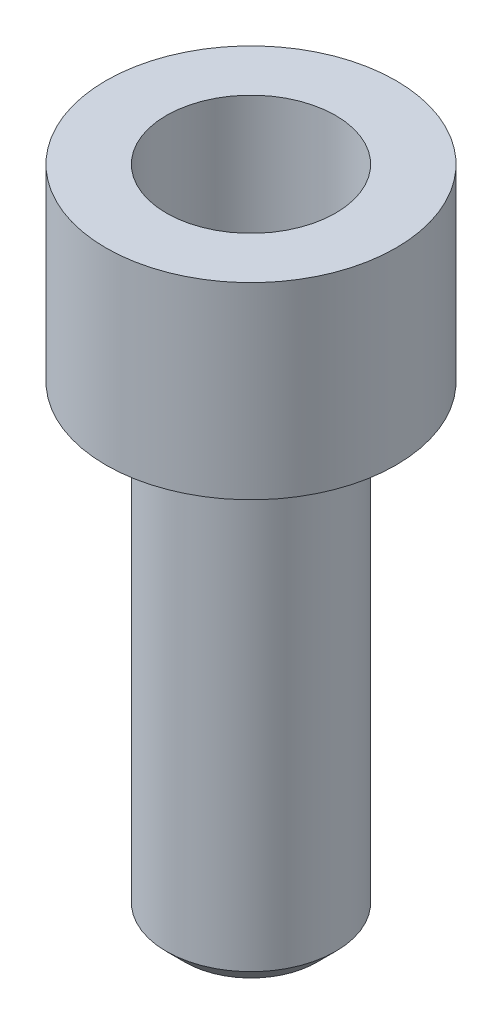
ISO-10303-21;
HEADER;
FILE_DESCRIPTION(('STEP AP214'),'2;1');
FILE_NAME('part.step','',(''),(''),'','','');
FILE_SCHEMA(('AUTOMOTIVE_DESIGN { 1 0 10303 214 1 1 1 1 }'));
ENDSEC;
DATA;
#1=APPLICATION_CONTEXT('core data for automotive mechanical design processes');
#2=APPLICATION_PROTOCOL_DEFINITION('international standard','automotive_design',2000,#1);
#3=PRODUCT_CONTEXT('',#1,'mechanical');
#4=PRODUCT('Part','Part','',(#3));
#5=PRODUCT_RELATED_PRODUCT_CATEGORY('part','',(#4));
#6=PRODUCT_DEFINITION_FORMATION('','',#4);
#7=PRODUCT_DEFINITION_CONTEXT('part definition',#1,'design');
#8=PRODUCT_DEFINITION('design','',#6,#7);
#9=PRODUCT_DEFINITION_SHAPE('','',#8);
#10=(LENGTH_UNIT() NAMED_UNIT(*) SI_UNIT(.MILLI.,.METRE.));
#11=(NAMED_UNIT(*) PLANE_ANGLE_UNIT() SI_UNIT($,.RADIAN.));
#12=(NAMED_UNIT(*) SI_UNIT($,.STERADIAN.) SOLID_ANGLE_UNIT());
#13=UNCERTAINTY_MEASURE_WITH_UNIT(LENGTH_MEASURE(1.E-05),#10,'distance_accuracy_value','');
#14=(GEOMETRIC_REPRESENTATION_CONTEXT(3) GLOBAL_UNCERTAINTY_ASSIGNED_CONTEXT((#13)) GLOBAL_UNIT_ASSIGNED_CONTEXT((#10,
#11,#12)) REPRESENTATION_CONTEXT('',''));
#15=CARTESIAN_POINT('',(0.,0.,0.));
#16=DIRECTION('',(0.,0.,1.));
#17=DIRECTION('',(1.,0.,0.));
#18=AXIS2_PLACEMENT_3D('',#15,#16,#17);
#19=CARTESIAN_POINT('',(4.5,15.2880894128114,0.));
#20=DIRECTION('',(0.,-1.,0.));
#21=DIRECTION('',(0.,0.,-1.));
#22=AXIS2_PLACEMENT_3D('',#19,#20,#21);
#23=PLANE('',#22);
#24=CARTESIAN_POINT('',(0.,15.2880894128114,0.));
#25=DIRECTION('',(0.,1.,0.));
#26=DIRECTION('',(0.,0.,1.));
#27=AXIS2_PLACEMENT_3D('',#24,#25,#26);
#28=CIRCLE('',#27,4.5);
#29=CARTESIAN_POINT('',(0.,15.2880894128114,4.5));
#30=VERTEX_POINT('',#29);
#31=EDGE_CURVE('E56',#30,#30,#28,.T.);
#32=ORIENTED_EDGE('',*,*,#31,.T.);
#33=EDGE_LOOP('',(#32));
#34=FACE_BOUND('',#33,.T.);
#35=ADVANCED_FACE('F31',(#34),#23,.F.);
#36=CARTESIAN_POINT('',(0.,-12.5901912811388,0.));
#37=DIRECTION('',(0.,1.,0.));
#38=DIRECTION('',(0.,0.,1.));
#39=AXIS2_PLACEMENT_3D('',#36,#37,#38);
#40=PLANE('',#39);
#41=CARTESIAN_POINT('',(0.,-12.5901912811388,0.));
#42=DIRECTION('',(0.,1.,0.));
#43=DIRECTION('',(0.,0.,1.));
#44=AXIS2_PLACEMENT_3D('',#41,#42,#43);
#45=CIRCLE('',#44,3.5);
#46=CARTESIAN_POINT('',(0.,-12.5901912811388,3.5));
#47=VERTEX_POINT('',#46);
#48=EDGE_CURVE('E10',#47,#47,#45,.T.);
#49=ORIENTED_EDGE('',*,*,#48,.F.);
#50=EDGE_LOOP('',(#49));
#51=FACE_BOUND('',#50,.T.);
#52=ADVANCED_FACE('F92',(#51),#40,.F.);
#53=CARTESIAN_POINT('',(0.,-12.5901912811388,0.));
#54=DIRECTION('',(0.,1.,0.));
#55=DIRECTION('',(0.,0.,1.));
#56=AXIS2_PLACEMENT_3D('',#53,#54,#55);
#57=CONICAL_SURFACE('',#56,3.5,0.785398163397448);
#58=CARTESIAN_POINT('',(0.,-11.5901912811388,0.));
#59=DIRECTION('',(0.,1.,0.));
#60=DIRECTION('',(0.,0.,1.));
#61=AXIS2_PLACEMENT_3D('',#58,#59,#60);
#62=CIRCLE('',#61,4.5);
#63=CARTESIAN_POINT('',(0.,-11.5901912811388,4.5));
#64=VERTEX_POINT('',#63);
#65=EDGE_CURVE('E37',#64,#64,#62,.T.);
#66=ORIENTED_EDGE('',*,*,#65,.F.);
#67=EDGE_LOOP('',(#66));
#68=FACE_BOUND('',#67,.T.);
#69=ORIENTED_EDGE('',*,*,#48,.T.);
#70=EDGE_LOOP('',(#69));
#71=FACE_BOUND('',#70,.T.);
#72=ADVANCED_FACE('F87',(#68,#71),#57,.T.);
#73=CARTESIAN_POINT('',(0.,27.3796771050987,0.));
#74=DIRECTION('',(0.,1.,0.));
#75=DIRECTION('',(0.,0.,1.));
#76=AXIS2_PLACEMENT_3D('',#73,#74,#75);
#77=CYLINDRICAL_SURFACE('',#76,4.5);
#78=CARTESIAN_POINT('',(0.,12.4098087188612,0.));
#79=DIRECTION('',(0.,1.,0.));
#80=DIRECTION('',(0.,0.,1.));
#81=AXIS2_PLACEMENT_3D('',#78,#79,#80);
#82=CIRCLE('',#81,4.5);
#83=CARTESIAN_POINT('',(0.,12.4098087188612,4.5));
#84=VERTEX_POINT('',#83);
#85=EDGE_CURVE('E41',#84,#84,#82,.T.);
#86=ORIENTED_EDGE('',*,*,#85,.F.);
#87=EDGE_LOOP('',(#86));
#88=FACE_BOUND('',#87,.T.);
#89=ORIENTED_EDGE('',*,*,#65,.T.);
#90=EDGE_LOOP('',(#89));
#91=FACE_BOUND('',#90,.T.);
#92=ADVANCED_FACE('F82',(#88,#91),#77,.T.);
#93=CARTESIAN_POINT('',(4.5,12.4098087188612,0.));
#94=DIRECTION('',(0.,1.,0.));
#95=DIRECTION('',(0.,0.,1.));
#96=AXIS2_PLACEMENT_3D('',#93,#94,#95);
#97=PLANE('',#96);
#98=CARTESIAN_POINT('',(0.,12.4098087188612,0.));
#99=DIRECTION('',(0.,1.,0.));
#100=DIRECTION('',(0.,0.,1.));
#101=AXIS2_PLACEMENT_3D('',#98,#99,#100);
#102=CIRCLE('',#101,7.71006499105092);
#103=CARTESIAN_POINT('',(0.,12.4098087188612,7.71006499105092));
#104=VERTEX_POINT('',#103);
#105=EDGE_CURVE('E45',#104,#104,#102,.T.);
#106=ORIENTED_EDGE('',*,*,#105,.F.);
#107=EDGE_LOOP('',(#106));
#108=FACE_BOUND('',#107,.T.);
#109=ORIENTED_EDGE('',*,*,#85,.T.);
#110=EDGE_LOOP('',(#109));
#111=FACE_BOUND('',#110,.T.);
#112=ADVANCED_FACE('F76',(#108,#111),#97,.F.);
#113=CARTESIAN_POINT('',(0.,27.3796771050987,0.));
#114=DIRECTION('',(0.,1.,0.));
#115=DIRECTION('',(0.,0.,1.));
#116=AXIS2_PLACEMENT_3D('',#113,#114,#115);
#117=CYLINDRICAL_SURFACE('',#116,7.71006499105092);
#118=CARTESIAN_POINT('',(0.,22.4098087188612,0.));
#119=DIRECTION('',(0.,1.,0.));
#120=DIRECTION('',(0.,0.,1.));
#121=AXIS2_PLACEMENT_3D('',#118,#119,#120);
#122=CIRCLE('',#121,7.71006499105092);
#123=CARTESIAN_POINT('',(0.,22.4098087188612,7.71006499105092));
#124=VERTEX_POINT('',#123);
#125=EDGE_CURVE('E50',#124,#124,#122,.T.);
#126=ORIENTED_EDGE('',*,*,#125,.F.);
#127=EDGE_LOOP('',(#126));
#128=FACE_BOUND('',#127,.T.);
#129=ORIENTED_EDGE('',*,*,#105,.T.);
#130=EDGE_LOOP('',(#129));
#131=FACE_BOUND('',#130,.T.);
#132=ADVANCED_FACE('F70',(#128,#131),#117,.T.);
#133=CARTESIAN_POINT('',(7.71006499105092,22.4098087188612,0.));
#134=DIRECTION('',(0.,-1.,0.));
#135=DIRECTION('',(0.,0.,-1.));
#136=AXIS2_PLACEMENT_3D('',#133,#134,#135);
#137=PLANE('',#136);
#138=CARTESIAN_POINT('',(0.,22.4098087188612,0.));
#139=DIRECTION('',(0.,1.,0.));
#140=DIRECTION('',(0.,0.,1.));
#141=AXIS2_PLACEMENT_3D('',#138,#139,#140);
#142=CIRCLE('',#141,4.5);
#143=CARTESIAN_POINT('',(0.,22.4098087188612,4.5));
#144=VERTEX_POINT('',#143);
#145=EDGE_CURVE('E53',#144,#144,#142,.T.);
#146=ORIENTED_EDGE('',*,*,#145,.F.);
#147=EDGE_LOOP('',(#146));
#148=FACE_BOUND('',#147,.T.);
#149=ORIENTED_EDGE('',*,*,#125,.T.);
#150=EDGE_LOOP('',(#149));
#151=FACE_BOUND('',#150,.T.);
#152=ADVANCED_FACE('F64',(#148,#151),#137,.F.);
#153=CARTESIAN_POINT('',(0.,27.3796771050987,0.));
#154=DIRECTION('',(0.,1.,0.));
#155=DIRECTION('',(0.,0.,1.));
#156=AXIS2_PLACEMENT_3D('',#153,#154,#155);
#157=CYLINDRICAL_SURFACE('',#156,4.5);
#158=ORIENTED_EDGE('',*,*,#31,.F.);
#159=EDGE_LOOP('',(#158));
#160=FACE_BOUND('',#159,.T.);
#161=ORIENTED_EDGE('',*,*,#145,.T.);
#162=EDGE_LOOP('',(#161));
#163=FACE_BOUND('',#162,.T.);
#164=ADVANCED_FACE('F61',(#160,#163),#157,.F.);
#165=CLOSED_SHELL('',(#35,#52,#72,#92,#112,#132,#152,#164));
#166=MANIFOLD_SOLID_BREP('B2',#165);
#167=ADVANCED_BREP_SHAPE_REPRESENTATION('',(#18,#166),#14);
#168=SHAPE_DEFINITION_REPRESENTATION(#9,#167);
ENDSEC;
END-ISO-10303-21;
